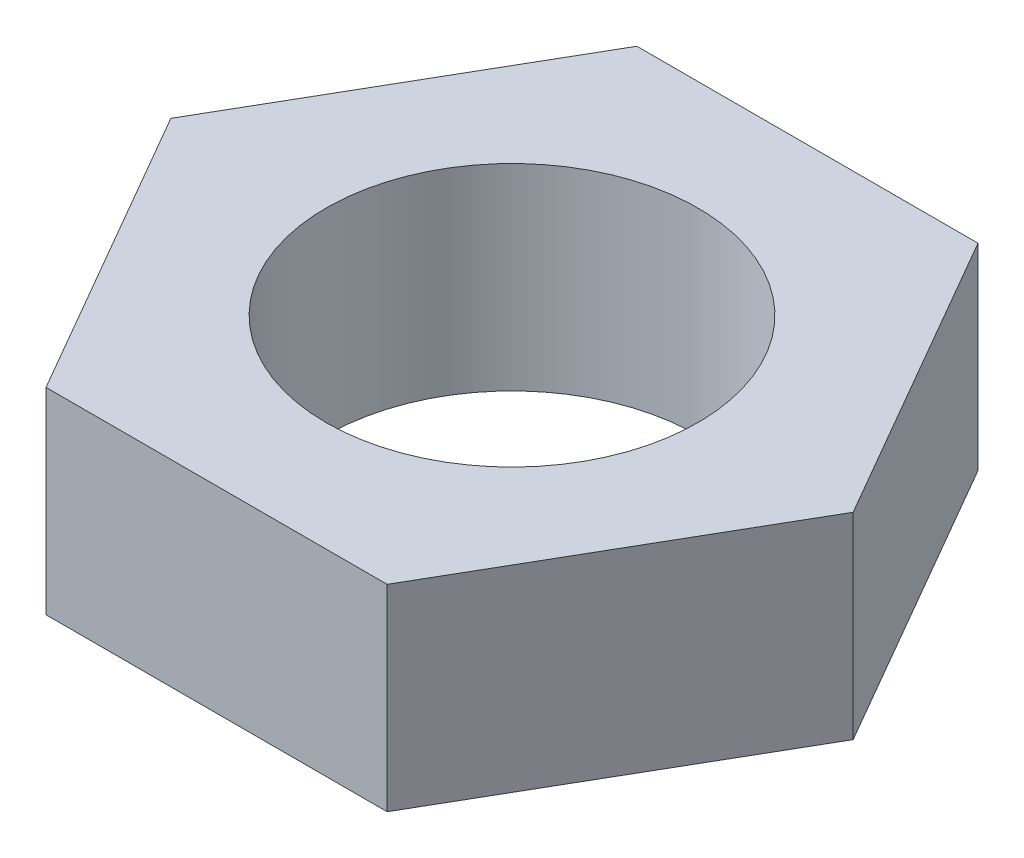
ISO-10303-21;
HEADER;
FILE_DESCRIPTION(('STEP AP214'),'2;1');
FILE_NAME('part.step','',(''),(''),'','','');
FILE_SCHEMA(('AUTOMOTIVE_DESIGN { 1 0 10303 214 1 1 1 1 }'));
ENDSEC;
DATA;
#1=APPLICATION_CONTEXT('core data for automotive mechanical design processes');
#2=APPLICATION_PROTOCOL_DEFINITION('international standard','automotive_design',2000,#1);
#3=PRODUCT_CONTEXT('',#1,'mechanical');
#4=PRODUCT('Part','Part','',(#3));
#5=PRODUCT_RELATED_PRODUCT_CATEGORY('part','',(#4));
#6=PRODUCT_DEFINITION_FORMATION('','',#4);
#7=PRODUCT_DEFINITION_CONTEXT('part definition',#1,'design');
#8=PRODUCT_DEFINITION('design','',#6,#7);
#9=PRODUCT_DEFINITION_SHAPE('','',#8);
#10=(LENGTH_UNIT() NAMED_UNIT(*) SI_UNIT(.MILLI.,.METRE.));
#11=(NAMED_UNIT(*) PLANE_ANGLE_UNIT() SI_UNIT($,.RADIAN.));
#12=(NAMED_UNIT(*) SI_UNIT($,.STERADIAN.) SOLID_ANGLE_UNIT());
#13=UNCERTAINTY_MEASURE_WITH_UNIT(LENGTH_MEASURE(1.E-05),#10,'distance_accuracy_value','');
#14=(GEOMETRIC_REPRESENTATION_CONTEXT(3) GLOBAL_UNCERTAINTY_ASSIGNED_CONTEXT((#13)) GLOBAL_UNIT_ASSIGNED_CONTEXT((#10,
#11,#12)) REPRESENTATION_CONTEXT('',''));
#15=CARTESIAN_POINT('',(0.,0.,0.));
#16=DIRECTION('',(0.,0.,1.));
#17=DIRECTION('',(1.,0.,0.));
#18=AXIS2_PLACEMENT_3D('',#15,#16,#17);
#19=CARTESIAN_POINT('',(1.37481532850781,1.5875,-2.38124999999999));
#20=DIRECTION('',(0.,1.,0.));
#21=DIRECTION('',(0.,0.,1.));
#22=AXIS2_PLACEMENT_3D('',#19,#20,#21);
#23=PLANE('',#22);
#24=DIRECTION('',(-0.499999999999999,0.,-0.866025403784439));
#25=VECTOR('',#24,1.);
#26=CARTESIAN_POINT('',(2.7496306570156,1.5875,0.));
#27=LINE('',#26,#25);
#28=CARTESIAN_POINT('',(2.7496306570156,1.5875,0.));
#29=VERTEX_POINT('',#28);
#30=CARTESIAN_POINT('',(1.37481532850781,1.5875,-2.38124999999999));
#31=VERTEX_POINT('',#30);
#32=EDGE_CURVE('E128',#29,#31,#27,.T.);
#33=ORIENTED_EDGE('',*,*,#32,.T.);
#34=DIRECTION('',(-1.,0.,0.));
#35=VECTOR('',#34,1.);
#36=CARTESIAN_POINT('',(1.37481532850781,1.5875,-2.38124999999999));
#37=LINE('',#36,#35);
#38=CARTESIAN_POINT('',(-1.3748153285078,1.5875,-2.38124999999999));
#39=VERTEX_POINT('',#38);
#40=EDGE_CURVE('E86',#31,#39,#37,.T.);
#41=ORIENTED_EDGE('',*,*,#40,.T.);
#42=DIRECTION('',(-0.5,0.,0.866025403784438));
#43=VECTOR('',#42,1.);
#44=CARTESIAN_POINT('',(-1.3748153285078,1.5875,-2.38124999999999));
#45=LINE('',#44,#43);
#46=CARTESIAN_POINT('',(-2.74963065701559,1.5875,0.));
#47=VERTEX_POINT('',#46);
#48=EDGE_CURVE('E99',#39,#47,#45,.T.);
#49=ORIENTED_EDGE('',*,*,#48,.T.);
#50=DIRECTION('',(0.500000000000001,0.,0.866025403784438));
#51=VECTOR('',#50,1.);
#52=CARTESIAN_POINT('',(-2.74963065701559,1.5875,0.));
#53=LINE('',#52,#51);
#54=CARTESIAN_POINT('',(-1.37481532850779,1.5875,2.38125000000001));
#55=VERTEX_POINT('',#54);
#56=EDGE_CURVE('E93',#47,#55,#53,.T.);
#57=ORIENTED_EDGE('',*,*,#56,.T.);
#58=DIRECTION('',(1.,0.,0.));
#59=VECTOR('',#58,1.);
#60=CARTESIAN_POINT('',(-1.37481532850779,1.5875,2.38125000000001));
#61=LINE('',#60,#59);
#62=CARTESIAN_POINT('',(1.37481532850779,1.5875,2.38125000000001));
#63=VERTEX_POINT('',#62);
#64=EDGE_CURVE('E97',#55,#63,#61,.T.);
#65=ORIENTED_EDGE('',*,*,#64,.T.);
#66=DIRECTION('',(0.500000000000001,0.,-0.866025403784438));
#67=VECTOR('',#66,1.);
#68=CARTESIAN_POINT('',(1.37481532850779,1.5875,2.38125000000001));
#69=LINE('',#68,#67);
#70=EDGE_CURVE('E49',#63,#29,#69,.T.);
#71=ORIENTED_EDGE('',*,*,#70,.T.);
#72=EDGE_LOOP('',(#33,#41,#49,#57,#65,#71));
#73=FACE_BOUND('',#72,.T.);
#74=CARTESIAN_POINT('',(0.,1.5875,0.));
#75=DIRECTION('',(0.,1.,0.));
#76=DIRECTION('',(0.,0.,1.));
#77=AXIS2_PLACEMENT_3D('',#74,#75,#76);
#78=CIRCLE('',#77,1.4986);
#79=CARTESIAN_POINT('',(0.,1.5875,1.4986));
#80=VERTEX_POINT('',#79);
#81=EDGE_CURVE('E121',#80,#80,#78,.T.);
#82=ORIENTED_EDGE('',*,*,#81,.F.);
#83=EDGE_LOOP('',(#82));
#84=FACE_BOUND('',#83,.T.);
#85=ADVANCED_FACE('F32',(#73,#84),#23,.T.);
#86=CARTESIAN_POINT('',(1.37481532850781,0.,-2.38124999999999));
#87=DIRECTION('',(0.,1.,0.));
#88=DIRECTION('',(0.,0.,1.));
#89=AXIS2_PLACEMENT_3D('',#86,#87,#88);
#90=PLANE('',#89);
#91=DIRECTION('',(-0.499999999999999,0.,-0.866025403784439));
#92=VECTOR('',#91,1.);
#93=CARTESIAN_POINT('',(2.7496306570156,0.,0.));
#94=LINE('',#93,#92);
#95=CARTESIAN_POINT('',(2.7496306570156,0.,0.));
#96=VERTEX_POINT('',#95);
#97=CARTESIAN_POINT('',(1.37481532850781,0.,-2.38124999999999));
#98=VERTEX_POINT('',#97);
#99=EDGE_CURVE('E117',#96,#98,#94,.T.);
#100=ORIENTED_EDGE('',*,*,#99,.F.);
#101=DIRECTION('',(0.500000000000001,0.,-0.866025403784438));
#102=VECTOR('',#101,1.);
#103=CARTESIAN_POINT('',(1.37481532850779,0.,2.38125000000001));
#104=LINE('',#103,#102);
#105=CARTESIAN_POINT('',(1.37481532850779,0.,2.38125000000001));
#106=VERTEX_POINT('',#105);
#107=EDGE_CURVE('E78',#106,#96,#104,.T.);
#108=ORIENTED_EDGE('',*,*,#107,.F.);
#109=DIRECTION('',(1.,0.,0.));
#110=VECTOR('',#109,1.);
#111=CARTESIAN_POINT('',(-1.37481532850779,0.,2.38125000000001));
#112=LINE('',#111,#110);
#113=CARTESIAN_POINT('',(-1.37481532850779,0.,2.38125000000001));
#114=VERTEX_POINT('',#113);
#115=EDGE_CURVE('E72',#114,#106,#112,.T.);
#116=ORIENTED_EDGE('',*,*,#115,.F.);
#117=DIRECTION('',(0.500000000000001,0.,0.866025403784438));
#118=VECTOR('',#117,1.);
#119=CARTESIAN_POINT('',(-2.74963065701559,0.,0.));
#120=LINE('',#119,#118);
#121=CARTESIAN_POINT('',(-2.74963065701559,0.,0.));
#122=VERTEX_POINT('',#121);
#123=EDGE_CURVE('E107',#122,#114,#120,.T.);
#124=ORIENTED_EDGE('',*,*,#123,.F.);
#125=DIRECTION('',(-0.5,0.,0.866025403784438));
#126=VECTOR('',#125,1.);
#127=CARTESIAN_POINT('',(-1.3748153285078,0.,-2.38124999999999));
#128=LINE('',#127,#126);
#129=CARTESIAN_POINT('',(-1.3748153285078,0.,-2.38124999999999));
#130=VERTEX_POINT('',#129);
#131=EDGE_CURVE('E123',#130,#122,#128,.T.);
#132=ORIENTED_EDGE('',*,*,#131,.F.);
#133=DIRECTION('',(-1.,0.,0.));
#134=VECTOR('',#133,1.);
#135=CARTESIAN_POINT('',(1.37481532850781,0.,-2.38124999999999));
#136=LINE('',#135,#134);
#137=EDGE_CURVE('E120',#98,#130,#136,.T.);
#138=ORIENTED_EDGE('',*,*,#137,.F.);
#139=EDGE_LOOP('',(#100,#108,#116,#124,#132,#138));
#140=FACE_BOUND('',#139,.T.);
#141=CARTESIAN_POINT('',(0.,0.,0.));
#142=DIRECTION('',(0.,1.,0.));
#143=DIRECTION('',(0.,0.,1.));
#144=AXIS2_PLACEMENT_3D('',#141,#142,#143);
#145=CIRCLE('',#144,1.4986);
#146=CARTESIAN_POINT('',(0.,0.,1.4986));
#147=VERTEX_POINT('',#146);
#148=EDGE_CURVE('E221',#147,#147,#145,.T.);
#149=ORIENTED_EDGE('',*,*,#148,.T.);
#150=EDGE_LOOP('',(#149));
#151=FACE_BOUND('',#150,.T.);
#152=ADVANCED_FACE('F137',(#140,#151),#90,.F.);
#153=CARTESIAN_POINT('',(2.7496306570156,1.5875,0.));
#154=DIRECTION('',(-0.866025403784439,0.,0.5));
#155=DIRECTION('',(0.499999999999999,0.,0.866025403784439));
#156=AXIS2_PLACEMENT_3D('',#153,#154,#155);
#157=PLANE('',#156);
#158=ORIENTED_EDGE('',*,*,#99,.T.);
#159=DIRECTION('',(0.,-1.,0.));
#160=VECTOR('',#159,1.);
#161=CARTESIAN_POINT('',(1.37481532850781,1.5875,-2.38124999999999));
#162=LINE('',#161,#160);
#163=EDGE_CURVE('E11',#31,#98,#162,.T.);
#164=ORIENTED_EDGE('',*,*,#163,.F.);
#165=ORIENTED_EDGE('',*,*,#32,.F.);
#166=DIRECTION('',(0.,-1.,0.));
#167=VECTOR('',#166,1.);
#168=CARTESIAN_POINT('',(2.7496306570156,1.5875,0.));
#169=LINE('',#168,#167);
#170=EDGE_CURVE('E113',#29,#96,#169,.T.);
#171=ORIENTED_EDGE('',*,*,#170,.T.);
#172=EDGE_LOOP('',(#158,#164,#165,#171));
#173=FACE_BOUND('',#172,.T.);
#174=ADVANCED_FACE('F34',(#173),#157,.F.);
#175=CARTESIAN_POINT('',(1.37481532850781,1.5875,-2.38124999999999));
#176=DIRECTION('',(0.,0.,1.));
#177=DIRECTION('',(1.,0.,0.));
#178=AXIS2_PLACEMENT_3D('',#175,#176,#177);
#179=PLANE('',#178);
#180=ORIENTED_EDGE('',*,*,#137,.T.);
#181=DIRECTION('',(0.,-1.,0.));
#182=VECTOR('',#181,1.);
#183=CARTESIAN_POINT('',(-1.3748153285078,1.5875,-2.38124999999999));
#184=LINE('',#183,#182);
#185=EDGE_CURVE('E41',#39,#130,#184,.T.);
#186=ORIENTED_EDGE('',*,*,#185,.F.);
#187=ORIENTED_EDGE('',*,*,#40,.F.);
#188=ORIENTED_EDGE('',*,*,#163,.T.);
#189=EDGE_LOOP('',(#180,#186,#187,#188));
#190=FACE_BOUND('',#189,.T.);
#191=ADVANCED_FACE('F162',(#190),#179,.F.);
#192=CARTESIAN_POINT('',(-1.3748153285078,1.5875,-2.38124999999999));
#193=DIRECTION('',(0.866025403784438,0.,0.5));
#194=DIRECTION('',(0.5,0.,-0.866025403784438));
#195=AXIS2_PLACEMENT_3D('',#192,#193,#194);
#196=PLANE('',#195);
#197=ORIENTED_EDGE('',*,*,#131,.T.);
#198=DIRECTION('',(0.,-1.,0.));
#199=VECTOR('',#198,1.);
#200=CARTESIAN_POINT('',(-2.74963065701559,1.5875,0.));
#201=LINE('',#200,#199);
#202=EDGE_CURVE('E108',#47,#122,#201,.T.);
#203=ORIENTED_EDGE('',*,*,#202,.F.);
#204=ORIENTED_EDGE('',*,*,#48,.F.);
#205=ORIENTED_EDGE('',*,*,#185,.T.);
#206=EDGE_LOOP('',(#197,#203,#204,#205));
#207=FACE_BOUND('',#206,.T.);
#208=ADVANCED_FACE('F134',(#207),#196,.F.);
#209=CARTESIAN_POINT('',(-2.74963065701559,1.5875,0.));
#210=DIRECTION('',(0.866025403784438,0.,-0.500000000000001));
#211=DIRECTION('',(-0.500000000000001,0.,-0.866025403784438));
#212=AXIS2_PLACEMENT_3D('',#209,#210,#211);
#213=PLANE('',#212);
#214=ORIENTED_EDGE('',*,*,#123,.T.);
#215=DIRECTION('',(0.,-1.,0.));
#216=VECTOR('',#215,1.);
#217=CARTESIAN_POINT('',(-1.37481532850779,1.5875,2.38125000000001));
#218=LINE('',#217,#216);
#219=EDGE_CURVE('E104',#55,#114,#218,.T.);
#220=ORIENTED_EDGE('',*,*,#219,.F.);
#221=ORIENTED_EDGE('',*,*,#56,.F.);
#222=ORIENTED_EDGE('',*,*,#202,.T.);
#223=EDGE_LOOP('',(#214,#220,#221,#222));
#224=FACE_BOUND('',#223,.T.);
#225=ADVANCED_FACE('F105',(#224),#213,.F.);
#226=CARTESIAN_POINT('',(-1.37481532850779,1.5875,2.38125000000001));
#227=DIRECTION('',(0.,0.,-1.));
#228=DIRECTION('',(-1.,0.,0.));
#229=AXIS2_PLACEMENT_3D('',#226,#227,#228);
#230=PLANE('',#229);
#231=ORIENTED_EDGE('',*,*,#115,.T.);
#232=DIRECTION('',(0.,-1.,0.));
#233=VECTOR('',#232,1.);
#234=CARTESIAN_POINT('',(1.37481532850779,1.5875,2.38125000000001));
#235=LINE('',#234,#233);
#236=EDGE_CURVE('E109',#63,#106,#235,.T.);
#237=ORIENTED_EDGE('',*,*,#236,.F.);
#238=ORIENTED_EDGE('',*,*,#64,.F.);
#239=ORIENTED_EDGE('',*,*,#219,.T.);
#240=EDGE_LOOP('',(#231,#237,#238,#239));
#241=FACE_BOUND('',#240,.T.);
#242=ADVANCED_FACE('F111',(#241),#230,.F.);
#243=CARTESIAN_POINT('',(1.37481532850779,1.5875,2.38125000000001));
#244=DIRECTION('',(-0.866025403784438,0.,-0.500000000000001));
#245=DIRECTION('',(-0.500000000000001,0.,0.866025403784438));
#246=AXIS2_PLACEMENT_3D('',#243,#244,#245);
#247=PLANE('',#246);
#248=ORIENTED_EDGE('',*,*,#107,.T.);
#249=ORIENTED_EDGE('',*,*,#170,.F.);
#250=ORIENTED_EDGE('',*,*,#70,.F.);
#251=ORIENTED_EDGE('',*,*,#236,.T.);
#252=EDGE_LOOP('',(#248,#249,#250,#251));
#253=FACE_BOUND('',#252,.T.);
#254=ADVANCED_FACE('F142',(#253),#247,.F.);
#255=CARTESIAN_POINT('',(0.,1.5875,0.));
#256=DIRECTION('',(0.,-1.,0.));
#257=DIRECTION('',(0.,0.,-1.));
#258=AXIS2_PLACEMENT_3D('',#255,#256,#257);
#259=CYLINDRICAL_SURFACE('',#258,1.4986);
#260=ORIENTED_EDGE('',*,*,#81,.T.);
#261=EDGE_LOOP('',(#260));
#262=FACE_BOUND('',#261,.T.);
#263=ORIENTED_EDGE('',*,*,#148,.F.);
#264=EDGE_LOOP('',(#263));
#265=FACE_BOUND('',#264,.T.);
#266=ADVANCED_FACE('F144',(#262,#265),#259,.F.);
#267=CLOSED_SHELL('',(#85,#152,#174,#191,#208,#225,#242,#254,#266));
#268=MANIFOLD_SOLID_BREP('B2',#267);
#269=ADVANCED_BREP_SHAPE_REPRESENTATION('',(#18,#268),#14);
#270=SHAPE_DEFINITION_REPRESENTATION(#9,#269);
ENDSEC;
END-ISO-10303-21;
